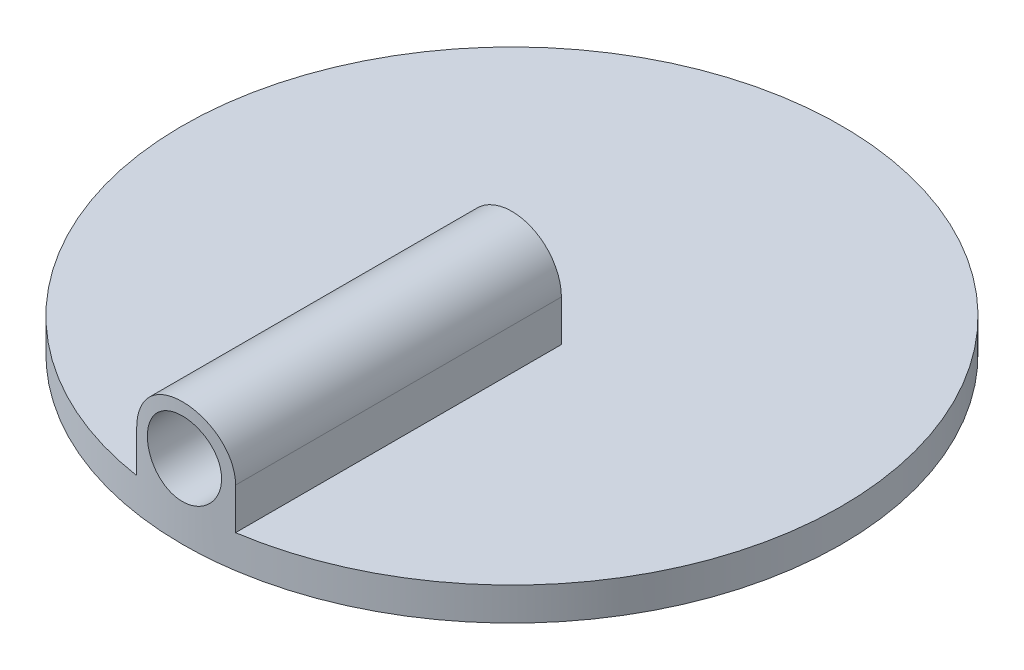
ISO-10303-21;
HEADER;
FILE_DESCRIPTION(('STEP AP214'),'2;1');
FILE_NAME('part.step','',(''),(''),'','','');
FILE_SCHEMA(('AUTOMOTIVE_DESIGN { 1 0 10303 214 1 1 1 1 }'));
ENDSEC;
DATA;
#1=APPLICATION_CONTEXT('core data for automotive mechanical design processes');
#2=APPLICATION_PROTOCOL_DEFINITION('international standard','automotive_design',2000,#1);
#3=PRODUCT_CONTEXT('',#1,'mechanical');
#4=PRODUCT('Part','Part','',(#3));
#5=PRODUCT_RELATED_PRODUCT_CATEGORY('part','',(#4));
#6=PRODUCT_DEFINITION_FORMATION('','',#4);
#7=PRODUCT_DEFINITION_CONTEXT('part definition',#1,'design');
#8=PRODUCT_DEFINITION('design','',#6,#7);
#9=PRODUCT_DEFINITION_SHAPE('','',#8);
#10=(LENGTH_UNIT() NAMED_UNIT(*) SI_UNIT(.MILLI.,.METRE.));
#11=(NAMED_UNIT(*) PLANE_ANGLE_UNIT() SI_UNIT($,.RADIAN.));
#12=(NAMED_UNIT(*) SI_UNIT($,.STERADIAN.) SOLID_ANGLE_UNIT());
#13=UNCERTAINTY_MEASURE_WITH_UNIT(LENGTH_MEASURE(1.E-05),#10,'distance_accuracy_value','');
#14=(GEOMETRIC_REPRESENTATION_CONTEXT(3) GLOBAL_UNCERTAINTY_ASSIGNED_CONTEXT((#13)) GLOBAL_UNIT_ASSIGNED_CONTEXT((#10,
#11,#12)) REPRESENTATION_CONTEXT('',''));
#15=CARTESIAN_POINT('',(0.,0.,0.));
#16=DIRECTION('',(0.,0.,1.));
#17=DIRECTION('',(1.,0.,0.));
#18=AXIS2_PLACEMENT_3D('',#15,#16,#17);
#19=CARTESIAN_POINT('',(0.,2.,0.));
#20=DIRECTION('',(0.,1.,0.));
#21=DIRECTION('',(0.,0.,1.));
#22=AXIS2_PLACEMENT_3D('',#19,#20,#21);
#23=PLANE('',#22);
#24=DIRECTION('',(1.,0.,0.));
#25=VECTOR('',#24,1.);
#26=CARTESIAN_POINT('',(-3.,2.,-0.0001));
#27=LINE('',#26,#25);
#28=CARTESIAN_POINT('',(-3.,2.,-0.0001));
#29=VERTEX_POINT('',#28);
#30=CARTESIAN_POINT('',(3.,2.,-0.0001));
#31=VERTEX_POINT('',#30);
#32=EDGE_CURVE('E102',#29,#31,#27,.T.);
#33=ORIENTED_EDGE('',*,*,#32,.T.);
#34=DIRECTION('',(0.,0.,1.));
#35=VECTOR('',#34,1.);
#36=CARTESIAN_POINT('',(3.,2.,-0.0001));
#37=LINE('',#36,#35);
#38=CARTESIAN_POINT('',(3.,2.,19.7737199332852));
#39=VERTEX_POINT('',#38);
#40=EDGE_CURVE('E90',#31,#39,#37,.T.);
#41=ORIENTED_EDGE('',*,*,#40,.T.);
#42=CARTESIAN_POINT('',(0.,2.,0.));
#43=DIRECTION('',(0.,1.,0.));
#44=DIRECTION('',(0.,0.,1.));
#45=AXIS2_PLACEMENT_3D('',#42,#43,#44);
#46=CIRCLE('',#45,20.);
#47=CARTESIAN_POINT('',(-3.,2.,19.7737199332852));
#48=VERTEX_POINT('',#47);
#49=EDGE_CURVE('E11',#39,#48,#46,.T.);
#50=ORIENTED_EDGE('',*,*,#49,.T.);
#51=DIRECTION('',(0.,0.,1.));
#52=VECTOR('',#51,1.);
#53=CARTESIAN_POINT('',(-3.,2.,-0.0001));
#54=LINE('',#53,#52);
#55=EDGE_CURVE('E82',#29,#48,#54,.T.);
#56=ORIENTED_EDGE('',*,*,#55,.F.);
#57=EDGE_LOOP('',(#33,#41,#50,#56));
#58=FACE_BOUND('',#57,.T.);
#59=ADVANCED_FACE('F38',(#58),#23,.T.);
#60=CARTESIAN_POINT('',(0.,2.,0.));
#61=DIRECTION('',(0.,-1.,0.));
#62=DIRECTION('',(0.,0.,-1.));
#63=AXIS2_PLACEMENT_3D('',#60,#61,#62);
#64=CYLINDRICAL_SURFACE('',#63,20.);
#65=ORIENTED_EDGE('',*,*,#49,.F.);
#66=DIRECTION('',(0.,-1.,0.));
#67=VECTOR('',#66,1.);
#68=CARTESIAN_POINT('',(3.,2.,19.7737199332852));
#69=LINE('',#68,#67);
#70=CARTESIAN_POINT('',(3.,4.5,19.7737199332852));
#71=VERTEX_POINT('',#70);
#72=EDGE_CURVE('E99',#71,#39,#69,.T.);
#73=ORIENTED_EDGE('',*,*,#72,.F.);
#74=CARTESIAN_POINT('',(-3.,4.5,19.7737199332852));
#75=CARTESIAN_POINT('',(-3.00000863551629,4.58387224141022,19.7737146130445));
#76=CARTESIAN_POINT('',(-2.99648279437387,4.66773999813719,19.7742534481973));
#77=CARTESIAN_POINT('',(-2.98242907478176,4.834866073531,19.7763800849375));
#78=CARTESIAN_POINT('',(-2.97190182666637,4.91812444637833,19.7779677920952));
#79=CARTESIAN_POINT('',(-2.9439284706993,5.08335041693469,19.7821504068792));
#80=CARTESIAN_POINT('',(-2.92649042766577,5.1653194038259,19.7847441404095));
#81=CARTESIAN_POINT('',(-2.88484422574278,5.32745973122105,19.7908593237067));
#82=CARTESIAN_POINT('',(-2.86063608827643,5.40763107741253,19.794380770538));
#83=CARTESIAN_POINT('',(-2.77807754347495,5.64464569042334,19.8061966140252));
#84=CARTESIAN_POINT('',(-2.70977528639416,5.79809348197636,19.815745331708));
#85=CARTESIAN_POINT('',(-2.54870518483027,6.09126338961192,19.8371030292374));
#86=CARTESIAN_POINT('',(-2.45593798653568,6.23098586808515,19.8489119493833));
#87=CARTESIAN_POINT('',(-2.24776489430587,6.4939544448383,19.8735650548908));
#88=CARTESIAN_POINT('',(-2.13220391237108,6.61707735709468,19.8864159558474));
#89=CARTESIAN_POINT('',(-1.88205193975063,6.84226676021666,19.9116461822051));
#90=CARTESIAN_POINT('',(-1.74745804606329,6.94433003310248,19.9240254353016));
#91=CARTESIAN_POINT('',(-1.46226868553602,7.12495541047063,19.9469872740781));
#92=CARTESIAN_POINT('',(-1.31159973229829,7.20340272406296,19.9575609791932));
#93=CARTESIAN_POINT('',(-0.99904826795823,7.33382635010271,19.9756445750105));
#94=CARTESIAN_POINT('',(-0.837167000236363,7.38580559238312,19.9831548048001));
#95=CARTESIAN_POINT('',(-0.508064228478872,7.46144628830335,19.9942182287316));
#96=CARTESIAN_POINT('',(-0.340891789264334,7.48531687257035,19.9978006322674));
#97=CARTESIAN_POINT('',(-0.00487446011080401,7.5047119838678,20.0007049110837));
#98=CARTESIAN_POINT('',(0.163970376715572,7.50023740823065,20.0000269212369));
#99=CARTESIAN_POINT('',(0.497103935300275,7.46323327020581,19.9945099850246));
#100=CARTESIAN_POINT('',(0.66141836821462,7.43092947349295,19.9897045238703));
#101=CARTESIAN_POINT('',(0.982266595361219,7.3395384226665,19.976509954662));
#102=CARTESIAN_POINT('',(1.13880023572213,7.28045063911198,19.9681207757685));
#103=CARTESIAN_POINT('',(1.44033053573864,7.13693663508506,19.9486436845886));
#104=CARTESIAN_POINT('',(1.58528105640214,7.05241490723297,19.9375456303629));
#105=CARTESIAN_POINT('',(1.8590209181275,6.86050519270629,19.9138882701456));
#106=CARTESIAN_POINT('',(1.9878098313497,6.75311660088935,19.9013289254868));
#107=CARTESIAN_POINT('',(2.22689189500494,6.51728057055662,19.8760049632111));
#108=CARTESIAN_POINT('',(2.33699328253084,6.38863875190767,19.8632395365886));
#109=CARTESIAN_POINT('',(2.53410732451872,6.11455677125226,19.839057360401));
#110=CARTESIAN_POINT('',(2.62111328571042,5.96911175701205,19.8276410023393));
#111=CARTESIAN_POINT('',(2.76959223267004,5.66533203975879,19.8074481748965));
#112=CARTESIAN_POINT('',(2.83103046264961,5.50698013881019,19.7986753034073));
#113=CARTESIAN_POINT('',(2.92629713463423,5.18215548654273,19.7848209900351));
#114=CARTESIAN_POINT('',(2.96016696752408,5.01569530866262,19.7797340154531));
#115=CARTESIAN_POINT('',(2.98652006652071,4.78999867351841,19.7757609037268));
#116=CARTESIAN_POINT('',(2.99157728447237,4.7320655493946,19.7749961608191));
#117=CARTESIAN_POINT('',(2.99831279381062,4.61609661516726,19.7739762264647));
#118=CARTESIAN_POINT('',(2.99999676461187,4.55806114259978,19.7737201785524));
#119=CARTESIAN_POINT('',(3.,4.5,19.7737199332852));
#120=B_SPLINE_CURVE_WITH_KNOTS('',3,(#74,#75,#76,#77,#78,#79,#80,#81,#82,#83,#84,#85,#86,#87,
#88,#89,#90,#91,#92,#93,#94,#95,#96,#97,#98,#99,#100,#101,#102,#103,#104,#105,#106,#107,#108,
#109,#110,#111,#112,#113,#114,#115,#116,#117,#118,#119),.UNSPECIFIED.,.F.,.F.,(4,2,2,2,2,2,2,2,
2,2,2,2,2,2,2,2,2,2,2,2,2,2,4),(0.,0.251532980479057,0.503043318593955,0.754261007269078,
1.00547790100653,1.50759921100594,2.00970725988502,2.51535742930763,3.02108480655751,
3.52923210863628,4.03732315007838,4.54160957795376,5.04588004154131,5.54609770639007,
6.04632525950764,6.54845517558607,7.05059838154284,7.55761802708196,8.06478445162059,
8.57263806425767,9.0797277773242,9.25412884440221,9.42823603105393),.UNSPECIFIED.);
#121=CARTESIAN_POINT('',(-3.,4.5,19.7737199332852));
#122=VERTEX_POINT('',#121);
#123=EDGE_CURVE('E98',#122,#71,#120,.T.);
#124=ORIENTED_EDGE('',*,*,#123,.F.);
#125=DIRECTION('',(0.,-1.,0.));
#126=VECTOR('',#125,1.);
#127=CARTESIAN_POINT('',(-3.,2.,19.7737199332852));
#128=LINE('',#127,#126);
#129=EDGE_CURVE('E85',#48,#122,#128,.F.);
#130=ORIENTED_EDGE('',*,*,#129,.F.);
#131=EDGE_LOOP('',(#65,#73,#124,#130));
#132=FACE_BOUND('',#131,.T.);
#133=CARTESIAN_POINT('',(0.,0.,0.));
#134=DIRECTION('',(0.,1.,0.));
#135=DIRECTION('',(0.,0.,1.));
#136=AXIS2_PLACEMENT_3D('',#133,#134,#135);
#137=CIRCLE('',#136,20.);
#138=CARTESIAN_POINT('',(0.,0.,20.));
#139=VERTEX_POINT('',#138);
#140=EDGE_CURVE('E43',#139,#139,#137,.T.);
#141=ORIENTED_EDGE('',*,*,#140,.T.);
#142=EDGE_LOOP('',(#141));
#143=FACE_BOUND('',#142,.T.);
#144=CARTESIAN_POINT('',(-2.25,4.5,19.8730344940072));
#145=CARTESIAN_POINT('',(-2.24999458913015,4.62595369054688,19.8730361406797));
#146=CARTESIAN_POINT('',(-2.23938812627404,4.75198851141793,19.8742448371527));
#147=CARTESIAN_POINT('',(-2.19724060084889,5.00055756096363,19.8789478101865));
#148=CARTESIAN_POINT('',(-2.1656770320116,5.12308787835818,19.882444543859));
#149=CARTESIAN_POINT('',(-2.08255149837596,5.36101264639444,19.8913226195215));
#150=CARTESIAN_POINT('',(-2.03100234155931,5.47641161243714,19.8967027542993));
#151=CARTESIAN_POINT('',(-1.90939491768443,5.69689679611024,19.9087399570687));
#152=CARTESIAN_POINT('',(-1.83934008414817,5.80198492184683,19.915396788121));
#153=CARTESIAN_POINT('',(-1.68236714634744,5.99936804350102,19.9292713387162));
#154=CARTESIAN_POINT('',(-1.59538162753517,6.09160927961957,19.9364912289858));
#155=CARTESIAN_POINT('',(-1.40716119252597,6.26021658306745,19.9506587898454));
#156=CARTESIAN_POINT('',(-1.30592559830155,6.3365818945819,19.9576064474621));
#157=CARTESIAN_POINT('',(-1.09174480727663,6.47145916800297,19.9704685952124));
#158=CARTESIAN_POINT('',(-0.97876910615251,6.5299229802005,19.9763802809598));
#159=CARTESIAN_POINT('',(-0.744526044241113,6.62702948821968,19.9864806505204));
#160=CARTESIAN_POINT('',(-0.623258935456934,6.66567278614862,19.9906693866727));
#161=CARTESIAN_POINT('',(-0.376422282952582,6.72188208560278,19.9968366346221));
#162=CARTESIAN_POINT('',(-0.250873220017381,6.73953698728714,19.9988244662726));
#163=CARTESIAN_POINT('',(0.00142049551258777,6.75354361941235,20.0003976928964));
#164=CARTESIAN_POINT('',(0.12816510938838,6.74989603740419,19.9999831654073));
#165=CARTESIAN_POINT('',(0.378647979373987,6.72147297111953,19.996805965211));
#166=CARTESIAN_POINT('',(0.502397237225005,6.6967930873186,19.9940539176828));
#167=CARTESIAN_POINT('',(0.743986141273657,6.62715516327685,19.9865229725523));
#168=CARTESIAN_POINT('',(0.861825693518214,6.58219680076029,19.9817440427377));
#169=CARTESIAN_POINT('',(1.08854895918618,6.47317479661097,19.9706781471734));
#170=CARTESIAN_POINT('',(1.19741237490264,6.40906929203495,19.9643878830266));
#171=CARTESIAN_POINT('',(1.40287168242605,6.26360314384814,19.951004171029));
#172=CARTESIAN_POINT('',(1.49946711820198,6.18224185909751,19.9439106933392));
#173=CARTESIAN_POINT('',(1.67820923809123,6.00403707602362,19.9296691988795));
#174=CARTESIAN_POINT('',(1.76027295000227,5.90711033956581,19.9225210976135));
#175=CARTESIAN_POINT('',(1.90697859119882,5.70081338124334,19.9090149780602));
#176=CARTESIAN_POINT('',(1.97162048287166,5.59144313251459,19.9026569614786));
#177=CARTESIAN_POINT('',(2.0816495572971,5.3632952086551,19.8914506675563));
#178=CARTESIAN_POINT('',(2.12703089730643,5.24451469184118,19.8866028484568));
#179=CARTESIAN_POINT('',(2.19718127190107,5.00095273679298,19.87897509456));
#180=CARTESIAN_POINT('',(2.22195110585027,4.87617153147843,19.8761950795687));
#181=CARTESIAN_POINT('',(2.25006712717512,4.62488076069395,19.8730319932861));
#182=CARTESIAN_POINT('',(2.25352971770565,4.49838437662384,19.8726358987102));
#183=CARTESIAN_POINT('',(2.23923933953435,4.2466132737359,19.8742511017788));
#184=CARTESIAN_POINT('',(2.22148673532503,4.12133853396661,19.8762623580632));
#185=CARTESIAN_POINT('',(2.16536758356073,3.87591060229067,19.8824537837116));
#186=CARTESIAN_POINT('',(2.12705670118085,3.75574452162372,19.8866280951774));
#187=CARTESIAN_POINT('',(2.03096554804936,3.52354313316177,19.8966705487804));
#188=CARTESIAN_POINT('',(1.97318471764594,3.41150805920013,19.9025387396065));
#189=CARTESIAN_POINT('',(1.83950480993164,3.19822022869044,19.9153391358318));
#190=CARTESIAN_POINT('',(1.76352897518029,3.09701585254479,19.9222758032368));
#191=CARTESIAN_POINT('',(1.59572503307018,2.90875427850529,19.9364172575945));
#192=CARTESIAN_POINT('',(1.50389642795294,2.82169752499697,19.9436220529605));
#193=CARTESIAN_POINT('',(1.3064869680376,2.66379746101877,19.9575276196954));
#194=CARTESIAN_POINT('',(1.2008449668368,2.59303034932912,19.9642259276473));
#195=CARTESIAN_POINT('',(0.979107307123759,2.47024409720865,19.9763274997791));
#196=CARTESIAN_POINT('',(0.863011824392043,2.41822464160016,19.9817307857297));
#197=CARTESIAN_POINT('',(0.62392265187253,2.33453790974881,19.9906224848487));
#198=CARTESIAN_POINT('',(0.500944905638056,2.30282555235986,19.9941151370352));
#199=CARTESIAN_POINT('',(0.251368681572809,2.26050629838774,19.9988095405613));
#200=CARTESIAN_POINT('',(0.124770334657939,2.24989863966418,20.0000113746278));
#201=CARTESIAN_POINT('',(-0.127707109228344,2.25010226534682,19.9999885234017));
#202=CARTESIAN_POINT('',(-0.253586318961173,2.2607956405321,19.9987771958615));
#203=CARTESIAN_POINT('',(-0.50174730647741,2.30304936732847,19.9940905572137));
#204=CARTESIAN_POINT('',(-0.624029083711667,2.33460972212493,19.9906152457605));
#205=CARTESIAN_POINT('',(-0.861516189072092,2.41766674132945,19.9817896761051));
#206=CARTESIAN_POINT('',(-0.976723111164348,2.46915889586491,19.976439842068));
#207=CARTESIAN_POINT('',(-1.19687846048688,2.59060555182071,19.9644596998159));
#208=CARTESIAN_POINT('',(-1.30182686079291,2.66056010169517,19.9578293882402));
#209=CARTESIAN_POINT('',(-1.49908971368129,2.81738555564089,19.9439859439064));
#210=CARTESIAN_POINT('',(-1.59133412032855,2.90434431373927,19.9367699032966));
#211=CARTESIAN_POINT('',(-1.75997021197351,3.09253076841181,19.9225923505473));
#212=CARTESIAN_POINT('',(-1.83635811302634,3.19376186123362,19.9156308994881));
#213=CARTESIAN_POINT('',(-1.97131167589358,3.40797815013071,19.9027273152717));
#214=CARTESIAN_POINT('',(-2.0298203997546,3.52099939142251,19.896788464361));
#215=CARTESIAN_POINT('',(-2.12694802577353,3.7552615580478,19.8866412060277));
#216=CARTESIAN_POINT('',(-2.16558898458423,3.87649319839834,19.8824308806945));
#217=CARTESIAN_POINT('',(-2.21242917430633,4.08198692223098,19.8772606255067));
#218=CARTESIAN_POINT('',(-2.22649850933422,4.16494307799272,19.8756835070133));
#219=CARTESIAN_POINT('',(-2.24528570107871,4.33192078187923,19.873569894757));
#220=CARTESIAN_POINT('',(-2.25000361105056,4.41594232393402,19.8730333950679));
#221=CARTESIAN_POINT('',(-2.25,4.5,19.8730344940072));
#222=B_SPLINE_CURVE_WITH_KNOTS('',3,(#144,#145,#146,#147,#148,#149,#150,#151,#152,#153,#154,
#155,#156,#157,#158,#159,#160,#161,#162,#163,#164,#165,#166,#167,#168,#169,#170,#171,#172,#173,
#174,#175,#176,#177,#178,#179,#180,#181,#182,#183,#184,#185,#186,#187,#188,#189,#190,#191,#192,
#193,#194,#195,#196,#197,#198,#199,#200,#201,#202,#203,#204,#205,#206,#207,#208,#209,#210,#211,
#212,#213,#214,#215,#216,#217,#218,#219,#220,#221),.UNSPECIFIED.,.T.,.F.,(4,2,2,2,2,2,2,2,2,2,2,
2,2,2,2,2,2,2,2,2,2,2,2,2,2,2,2,2,2,2,2,2,2,2,2,2,2,2,4),(0.,0.377554056388311,
0.755514233094379,1.1332325892271,1.51088091309401,1.8900649094204,2.26926695366028,
2.64948015630804,3.02968180816067,3.40826724303547,3.78684045889617,4.16370202583318,
4.54056958225412,4.91826722254244,5.29597889867516,5.67578215921603,6.05558623972315,
6.4355054526732,6.81540993075339,7.19323710463048,7.57105778725485,7.94786057772641,
8.32467420008888,8.70310635359295,9.08155039158721,9.46173026325407,9.84190374319971,
10.221230296507,10.6005431511902,10.9777622011511,11.3549813086945,11.7321151145259,
12.1092499101459,12.4883873062635,12.8676150747448,13.2480382382192,13.6280381493533,
13.8800077198169,14.1319758553395),.UNSPECIFIED.);
#223=CARTESIAN_POINT('',(-2.25,4.5,19.8730344940072));
#224=VERTEX_POINT('',#223);
#225=EDGE_CURVE('E116',#224,#224,#222,.T.);
#226=ORIENTED_EDGE('',*,*,#225,.T.);
#227=EDGE_LOOP('',(#226));
#228=FACE_BOUND('',#227,.T.);
#229=ADVANCED_FACE('F40',(#132,#143,#228),#64,.T.);
#230=CARTESIAN_POINT('',(0.,0.,0.));
#231=DIRECTION('',(0.,1.,0.));
#232=DIRECTION('',(0.,0.,1.));
#233=AXIS2_PLACEMENT_3D('',#230,#231,#232);
#234=PLANE('',#233);
#235=ORIENTED_EDGE('',*,*,#140,.F.);
#236=EDGE_LOOP('',(#235));
#237=FACE_BOUND('',#236,.T.);
#238=ADVANCED_FACE('F143',(#237),#234,.F.);
#239=CARTESIAN_POINT('',(0.,4.5,-0.0001));
#240=DIRECTION('',(0.,0.,1.));
#241=DIRECTION('',(1.,0.,0.));
#242=AXIS2_PLACEMENT_3D('',#239,#240,#241);
#243=CYLINDRICAL_SURFACE('',#242,3.);
#244=DIRECTION('',(0.,0.,1.));
#245=VECTOR('',#244,1.);
#246=CARTESIAN_POINT('',(-3.,4.5,-0.0001));
#247=LINE('',#246,#245);
#248=CARTESIAN_POINT('',(-3.,4.5,-0.0001));
#249=VERTEX_POINT('',#248);
#250=EDGE_CURVE('E91',#249,#122,#247,.T.);
#251=ORIENTED_EDGE('',*,*,#250,.T.);
#252=ORIENTED_EDGE('',*,*,#123,.T.);
#253=DIRECTION('',(0.,0.,1.));
#254=VECTOR('',#253,1.);
#255=CARTESIAN_POINT('',(3.,4.5,-0.0001));
#256=LINE('',#255,#254);
#257=CARTESIAN_POINT('',(3.,4.5,-0.0001));
#258=VERTEX_POINT('',#257);
#259=EDGE_CURVE('E62',#258,#71,#256,.T.);
#260=ORIENTED_EDGE('',*,*,#259,.F.);
#261=CARTESIAN_POINT('',(0.,4.5,-0.0001));
#262=DIRECTION('',(0.,0.,1.));
#263=DIRECTION('',(1.,0.,0.));
#264=AXIS2_PLACEMENT_3D('',#261,#262,#263);
#265=CIRCLE('',#264,3.);
#266=EDGE_CURVE('E111',#258,#249,#265,.T.);
#267=ORIENTED_EDGE('',*,*,#266,.T.);
#268=EDGE_LOOP('',(#251,#252,#260,#267));
#269=FACE_BOUND('',#268,.T.);
#270=ADVANCED_FACE('F138',(#269),#243,.T.);
#271=CARTESIAN_POINT('',(3.,2.,-0.0001));
#272=DIRECTION('',(1.,0.,0.));
#273=DIRECTION('',(0.,1.,0.));
#274=AXIS2_PLACEMENT_3D('',#271,#272,#273);
#275=PLANE('',#274);
#276=ORIENTED_EDGE('',*,*,#259,.T.);
#277=ORIENTED_EDGE('',*,*,#72,.T.);
#278=ORIENTED_EDGE('',*,*,#40,.F.);
#279=DIRECTION('',(0.,1.,0.));
#280=VECTOR('',#279,1.);
#281=CARTESIAN_POINT('',(3.,2.,-0.0001));
#282=LINE('',#281,#280);
#283=EDGE_CURVE('E54',#31,#258,#282,.T.);
#284=ORIENTED_EDGE('',*,*,#283,.T.);
#285=EDGE_LOOP('',(#276,#277,#278,#284));
#286=FACE_BOUND('',#285,.T.);
#287=ADVANCED_FACE('F135',(#286),#275,.T.);
#288=CARTESIAN_POINT('',(-3.,4.5,-0.0001));
#289=DIRECTION('',(-1.,0.,0.));
#290=DIRECTION('',(0.,-1.,0.));
#291=AXIS2_PLACEMENT_3D('',#288,#289,#290);
#292=PLANE('',#291);
#293=ORIENTED_EDGE('',*,*,#55,.T.);
#294=ORIENTED_EDGE('',*,*,#129,.T.);
#295=ORIENTED_EDGE('',*,*,#250,.F.);
#296=DIRECTION('',(0.,-1.,0.));
#297=VECTOR('',#296,1.);
#298=CARTESIAN_POINT('',(-3.,4.5,-0.0001));
#299=LINE('',#298,#297);
#300=EDGE_CURVE('E87',#249,#29,#299,.T.);
#301=ORIENTED_EDGE('',*,*,#300,.T.);
#302=EDGE_LOOP('',(#293,#294,#295,#301));
#303=FACE_BOUND('',#302,.T.);
#304=ADVANCED_FACE('F84',(#303),#292,.T.);
#305=CARTESIAN_POINT('',(0.,4.5,-0.0001));
#306=DIRECTION('',(0.,0.,1.));
#307=DIRECTION('',(1.,0.,0.));
#308=AXIS2_PLACEMENT_3D('',#305,#306,#307);
#309=PLANE('',#308);
#310=CARTESIAN_POINT('',(0.,4.5,-0.0001));
#311=DIRECTION('',(0.,0.,1.));
#312=DIRECTION('',(1.,0.,0.));
#313=AXIS2_PLACEMENT_3D('',#310,#311,#312);
#314=CIRCLE('',#313,2.25);
#315=CARTESIAN_POINT('',(2.25,4.5,-0.0001));
#316=VERTEX_POINT('',#315);
#317=EDGE_CURVE('E113',#316,#316,#314,.T.);
#318=ORIENTED_EDGE('',*,*,#317,.T.);
#319=EDGE_LOOP('',(#318));
#320=FACE_BOUND('',#319,.T.);
#321=ORIENTED_EDGE('',*,*,#266,.F.);
#322=ORIENTED_EDGE('',*,*,#283,.F.);
#323=ORIENTED_EDGE('',*,*,#32,.F.);
#324=ORIENTED_EDGE('',*,*,#300,.F.);
#325=EDGE_LOOP('',(#321,#322,#323,#324));
#326=FACE_BOUND('',#325,.T.);
#327=ADVANCED_FACE('F130',(#320,#326),#309,.F.);
#328=CARTESIAN_POINT('',(0.,4.5,-0.0001));
#329=DIRECTION('',(0.,0.,1.));
#330=DIRECTION('',(1.,0.,0.));
#331=AXIS2_PLACEMENT_3D('',#328,#329,#330);
#332=CYLINDRICAL_SURFACE('',#331,2.25);
#333=ORIENTED_EDGE('',*,*,#317,.F.);
#334=EDGE_LOOP('',(#333));
#335=FACE_BOUND('',#334,.T.);
#336=ORIENTED_EDGE('',*,*,#225,.F.);
#337=EDGE_LOOP('',(#336));
#338=FACE_BOUND('',#337,.T.);
#339=ADVANCED_FACE('F127',(#335,#338),#332,.F.);
#340=CLOSED_SHELL('',(#59,#229,#238,#270,#287,#304,#327,#339));
#341=MANIFOLD_SOLID_BREP('B2',#340);
#342=ADVANCED_BREP_SHAPE_REPRESENTATION('',(#18,#341),#14);
#343=SHAPE_DEFINITION_REPRESENTATION(#9,#342);
ENDSEC;
END-ISO-10303-21;
